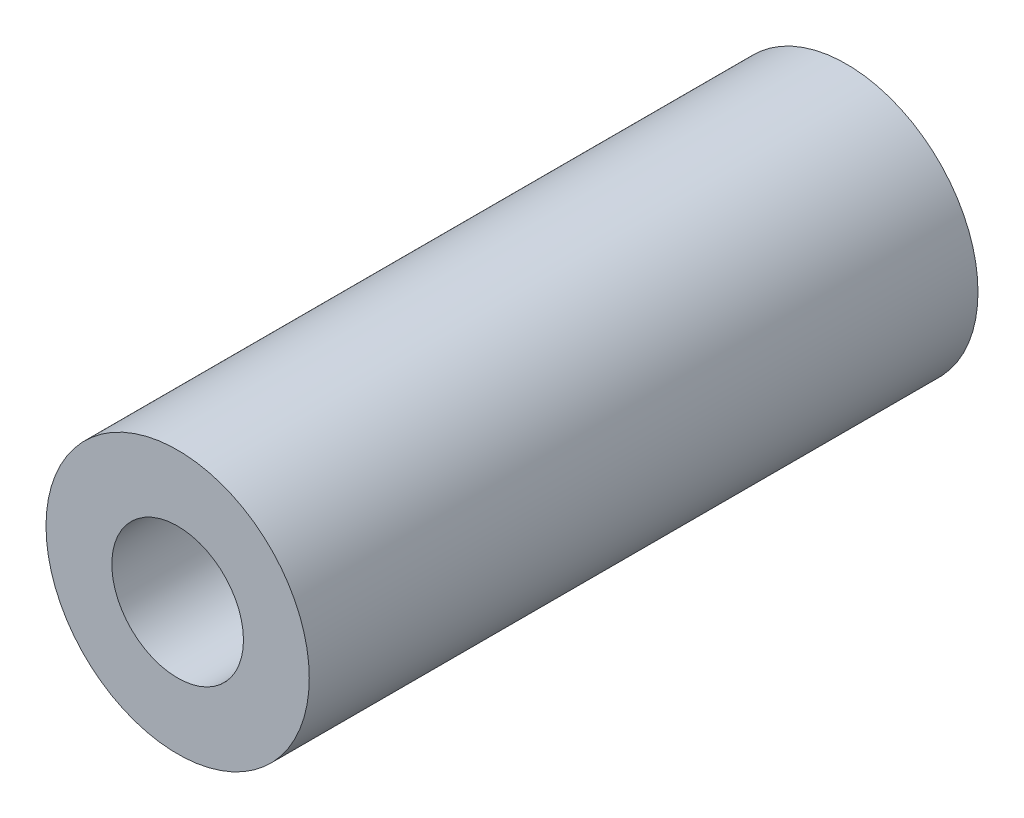
ISO-10303-21;
HEADER;
FILE_DESCRIPTION(('STEP AP214'),'2;1');
FILE_NAME('part.step','',(''),(''),'','','');
FILE_SCHEMA(('AUTOMOTIVE_DESIGN { 1 0 10303 214 1 1 1 1 }'));
ENDSEC;
DATA;
#1=APPLICATION_CONTEXT('core data for automotive mechanical design processes');
#2=APPLICATION_PROTOCOL_DEFINITION('international standard','automotive_design',2000,#1);
#3=PRODUCT_CONTEXT('',#1,'mechanical');
#4=PRODUCT('Part','Part','',(#3));
#5=PRODUCT_RELATED_PRODUCT_CATEGORY('part','',(#4));
#6=PRODUCT_DEFINITION_FORMATION('','',#4);
#7=PRODUCT_DEFINITION_CONTEXT('part definition',#1,'design');
#8=PRODUCT_DEFINITION('design','',#6,#7);
#9=PRODUCT_DEFINITION_SHAPE('','',#8);
#10=(LENGTH_UNIT() NAMED_UNIT(*) SI_UNIT(.MILLI.,.METRE.));
#11=(NAMED_UNIT(*) PLANE_ANGLE_UNIT() SI_UNIT($,.RADIAN.));
#12=(NAMED_UNIT(*) SI_UNIT($,.STERADIAN.) SOLID_ANGLE_UNIT());
#13=UNCERTAINTY_MEASURE_WITH_UNIT(LENGTH_MEASURE(1.E-05),#10,'distance_accuracy_value','');
#14=(GEOMETRIC_REPRESENTATION_CONTEXT(3) GLOBAL_UNCERTAINTY_ASSIGNED_CONTEXT((#13)) GLOBAL_UNIT_ASSIGNED_CONTEXT((#10,
#11,#12)) REPRESENTATION_CONTEXT('',''));
#15=CARTESIAN_POINT('',(0.,0.,0.));
#16=DIRECTION('',(0.,0.,1.));
#17=DIRECTION('',(1.,0.,0.));
#18=AXIS2_PLACEMENT_3D('',#15,#16,#17);
#19=CARTESIAN_POINT('',(0.,0.,32.258));
#20=DIRECTION('',(0.,0.,1.));
#21=DIRECTION('',(1.,0.,0.));
#22=AXIS2_PLACEMENT_3D('',#19,#20,#21);
#23=PLANE('',#22);
#24=CARTESIAN_POINT('',(0.,0.,32.258));
#25=DIRECTION('',(0.,0.,1.));
#26=DIRECTION('',(1.,0.,0.));
#27=AXIS2_PLACEMENT_3D('',#24,#25,#26);
#28=CIRCLE('',#27,6.35);
#29=CARTESIAN_POINT('',(6.35,0.,32.258));
#30=VERTEX_POINT('',#29);
#31=EDGE_CURVE('E10',#30,#30,#28,.T.);
#32=ORIENTED_EDGE('',*,*,#31,.T.);
#33=EDGE_LOOP('',(#32));
#34=FACE_BOUND('',#33,.T.);
#35=CARTESIAN_POINT('',(0.,0.,32.258));
#36=DIRECTION('',(0.,0.,1.));
#37=DIRECTION('',(1.,0.,0.));
#38=AXIS2_PLACEMENT_3D('',#35,#36,#37);
#39=CIRCLE('',#38,3.175);
#40=CARTESIAN_POINT('',(3.175,0.,32.258));
#41=VERTEX_POINT('',#40);
#42=EDGE_CURVE('E41',#41,#41,#39,.T.);
#43=ORIENTED_EDGE('',*,*,#42,.F.);
#44=EDGE_LOOP('',(#43));
#45=FACE_BOUND('',#44,.T.);
#46=ADVANCED_FACE('F30',(#34,#45),#23,.T.);
#47=CARTESIAN_POINT('',(0.,0.,0.));
#48=DIRECTION('',(0.,0.,1.));
#49=DIRECTION('',(1.,0.,0.));
#50=AXIS2_PLACEMENT_3D('',#47,#48,#49);
#51=PLANE('',#50);
#52=CARTESIAN_POINT('',(0.,0.,0.));
#53=DIRECTION('',(0.,0.,1.));
#54=DIRECTION('',(1.,0.,0.));
#55=AXIS2_PLACEMENT_3D('',#52,#53,#54);
#56=CIRCLE('',#55,6.35);
#57=CARTESIAN_POINT('',(6.35,0.,0.));
#58=VERTEX_POINT('',#57);
#59=EDGE_CURVE('E34',#58,#58,#56,.T.);
#60=ORIENTED_EDGE('',*,*,#59,.F.);
#61=EDGE_LOOP('',(#60));
#62=FACE_BOUND('',#61,.T.);
#63=CARTESIAN_POINT('',(0.,0.,0.));
#64=DIRECTION('',(0.,0.,1.));
#65=DIRECTION('',(1.,0.,0.));
#66=AXIS2_PLACEMENT_3D('',#63,#64,#65);
#67=CIRCLE('',#66,3.175);
#68=CARTESIAN_POINT('',(3.175,0.,0.));
#69=VERTEX_POINT('',#68);
#70=EDGE_CURVE('E43',#69,#69,#67,.T.);
#71=ORIENTED_EDGE('',*,*,#70,.T.);
#72=EDGE_LOOP('',(#71));
#73=FACE_BOUND('',#72,.T.);
#74=ADVANCED_FACE('F53',(#62,#73),#51,.F.);
#75=CARTESIAN_POINT('',(0.,0.,32.258));
#76=DIRECTION('',(0.,0.,-1.));
#77=DIRECTION('',(-1.,0.,0.));
#78=AXIS2_PLACEMENT_3D('',#75,#76,#77);
#79=CYLINDRICAL_SURFACE('',#78,6.35);
#80=ORIENTED_EDGE('',*,*,#31,.F.);
#81=EDGE_LOOP('',(#80));
#82=FACE_BOUND('',#81,.T.);
#83=ORIENTED_EDGE('',*,*,#59,.T.);
#84=EDGE_LOOP('',(#83));
#85=FACE_BOUND('',#84,.T.);
#86=ADVANCED_FACE('F32',(#82,#85),#79,.T.);
#87=CARTESIAN_POINT('',(0.,0.,32.258));
#88=DIRECTION('',(0.,0.,-1.));
#89=DIRECTION('',(-1.,0.,0.));
#90=AXIS2_PLACEMENT_3D('',#87,#88,#89);
#91=CYLINDRICAL_SURFACE('',#90,3.175);
#92=ORIENTED_EDGE('',*,*,#42,.T.);
#93=EDGE_LOOP('',(#92));
#94=FACE_BOUND('',#93,.T.);
#95=ORIENTED_EDGE('',*,*,#70,.F.);
#96=EDGE_LOOP('',(#95));
#97=FACE_BOUND('',#96,.T.);
#98=ADVANCED_FACE('F49',(#94,#97),#91,.F.);
#99=CLOSED_SHELL('',(#46,#74,#86,#98));
#100=MANIFOLD_SOLID_BREP('B2',#99);
#101=ADVANCED_BREP_SHAPE_REPRESENTATION('',(#18,#100),#14);
#102=SHAPE_DEFINITION_REPRESENTATION(#9,#101);
ENDSEC;
END-ISO-10303-21;
